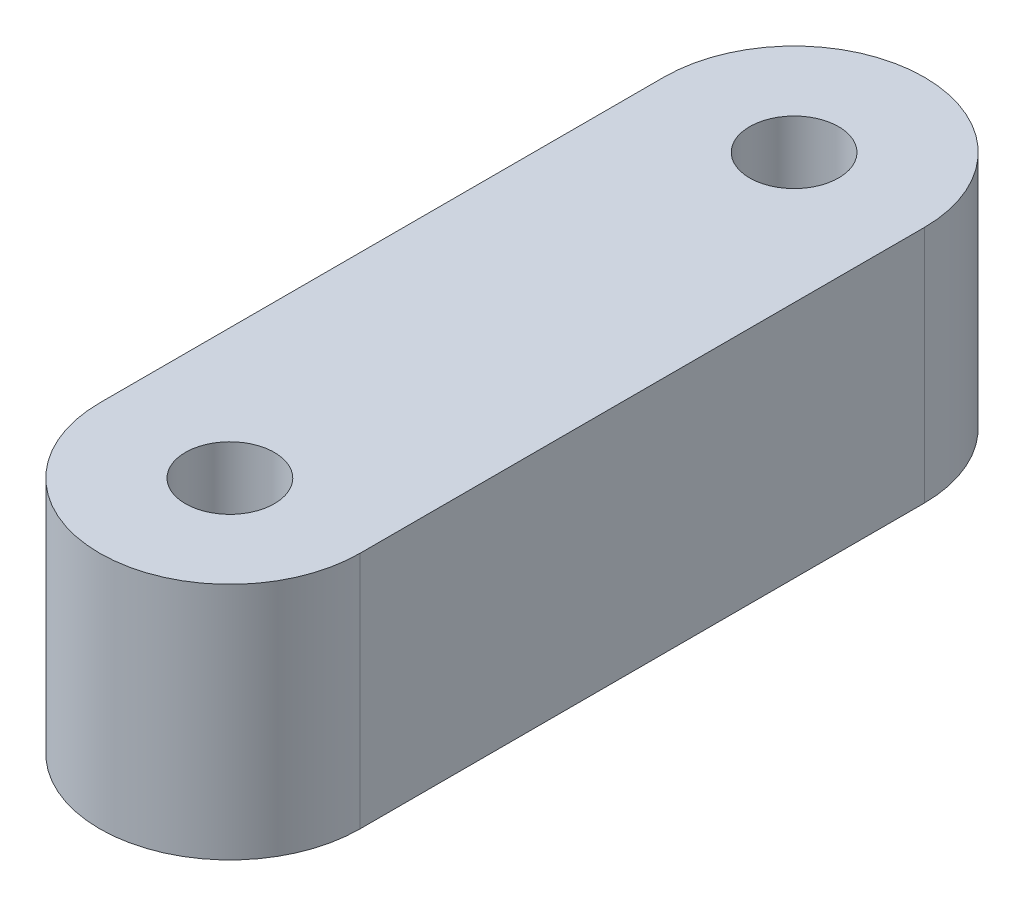
ISO-10303-21;
HEADER;
FILE_DESCRIPTION(('STEP AP214'),'2;1');
FILE_NAME('part.step','',(''),(''),'','','');
FILE_SCHEMA(('AUTOMOTIVE_DESIGN { 1 0 10303 214 1 1 1 1 }'));
ENDSEC;
DATA;
#1=APPLICATION_CONTEXT('core data for automotive mechanical design processes');
#2=APPLICATION_PROTOCOL_DEFINITION('international standard','automotive_design',2000,#1);
#3=PRODUCT_CONTEXT('',#1,'mechanical');
#4=PRODUCT('Part','Part','',(#3));
#5=PRODUCT_RELATED_PRODUCT_CATEGORY('part','',(#4));
#6=PRODUCT_DEFINITION_FORMATION('','',#4);
#7=PRODUCT_DEFINITION_CONTEXT('part definition',#1,'design');
#8=PRODUCT_DEFINITION('design','',#6,#7);
#9=PRODUCT_DEFINITION_SHAPE('','',#8);
#10=(LENGTH_UNIT() NAMED_UNIT(*) SI_UNIT(.MILLI.,.METRE.));
#11=(NAMED_UNIT(*) PLANE_ANGLE_UNIT() SI_UNIT($,.RADIAN.));
#12=(NAMED_UNIT(*) SI_UNIT($,.STERADIAN.) SOLID_ANGLE_UNIT());
#13=UNCERTAINTY_MEASURE_WITH_UNIT(LENGTH_MEASURE(1.E-05),#10,'distance_accuracy_value','');
#14=(GEOMETRIC_REPRESENTATION_CONTEXT(3) GLOBAL_UNCERTAINTY_ASSIGNED_CONTEXT((#13)) GLOBAL_UNIT_ASSIGNED_CONTEXT((#10,
#11,#12)) REPRESENTATION_CONTEXT('',''));
#15=CARTESIAN_POINT('',(0.,0.,0.));
#16=DIRECTION('',(0.,0.,1.));
#17=DIRECTION('',(1.,0.,0.));
#18=AXIS2_PLACEMENT_3D('',#15,#16,#17);
#19=CARTESIAN_POINT('',(4.,5.5,0.));
#20=DIRECTION('',(-1.,0.,0.));
#21=DIRECTION('',(0.,0.,1.));
#22=AXIS2_PLACEMENT_3D('',#19,#20,#21);
#23=CYLINDRICAL_SURFACE('',#22,3.6);
#24=DIRECTION('',(-1.,0.,0.));
#25=VECTOR('',#24,1.);
#26=CARTESIAN_POINT('',(4.,3.45,2.95930735139154));
#27=LINE('',#26,#25);
#28=CARTESIAN_POINT('',(4.,3.45,2.95930735139154));
#29=VERTEX_POINT('',#28);
#30=CARTESIAN_POINT('',(-6.,3.45,2.95930735139154));
#31=VERTEX_POINT('',#30);
#32=EDGE_CURVE('E55',#29,#31,#27,.T.);
#33=ORIENTED_EDGE('',*,*,#32,.T.);
#34=CARTESIAN_POINT('',(-6.,5.5,0.));
#35=DIRECTION('',(-1.,0.,0.));
#36=DIRECTION('',(0.,0.,1.));
#37=AXIS2_PLACEMENT_3D('',#34,#35,#36);
#38=CIRCLE('',#37,3.6);
#39=CARTESIAN_POINT('',(-6.,3.45,-2.95930735139154));
#40=VERTEX_POINT('',#39);
#41=EDGE_CURVE('E113',#31,#40,#38,.T.);
#42=ORIENTED_EDGE('',*,*,#41,.T.);
#43=DIRECTION('',(-1.,0.,0.));
#44=VECTOR('',#43,1.);
#45=CARTESIAN_POINT('',(4.,3.45,-2.95930735139154));
#46=LINE('',#45,#44);
#47=CARTESIAN_POINT('',(4.,3.45,-2.95930735139154));
#48=VERTEX_POINT('',#47);
#49=EDGE_CURVE('E102',#48,#40,#46,.T.);
#50=ORIENTED_EDGE('',*,*,#49,.F.);
#51=CARTESIAN_POINT('',(4.,5.5,0.));
#52=DIRECTION('',(-1.,0.,0.));
#53=DIRECTION('',(0.,0.,1.));
#54=AXIS2_PLACEMENT_3D('',#51,#52,#53);
#55=CIRCLE('',#54,3.6);
#56=EDGE_CURVE('E111',#29,#48,#55,.T.);
#57=ORIENTED_EDGE('',*,*,#56,.F.);
#58=EDGE_LOOP('',(#33,#42,#50,#57));
#59=FACE_BOUND('',#58,.T.);
#60=ADVANCED_FACE('F40',(#59),#23,.F.);
#61=CARTESIAN_POINT('',(4.,5.5,0.));
#62=DIRECTION('',(-1.,0.,0.));
#63=DIRECTION('',(0.,0.,1.));
#64=AXIS2_PLACEMENT_3D('',#61,#62,#63);
#65=PLANE('',#64);
#66=ORIENTED_EDGE('',*,*,#56,.T.);
#67=DIRECTION('',(0.,0.,1.));
#68=VECTOR('',#67,1.);
#69=CARTESIAN_POINT('',(4.,3.45,0.));
#70=LINE('',#69,#68);
#71=EDGE_CURVE('E99',#48,#29,#70,.T.);
#72=ORIENTED_EDGE('',*,*,#71,.T.);
#73=EDGE_LOOP('',(#66,#72));
#74=FACE_BOUND('',#73,.T.);
#75=ADVANCED_FACE('F115',(#74),#65,.T.);
#76=CARTESIAN_POINT('',(0.,11.,13.));
#77=DIRECTION('',(0.,-1.,0.));
#78=DIRECTION('',(0.,0.,-1.));
#79=AXIS2_PLACEMENT_3D('',#76,#77,#78);
#80=CYLINDRICAL_SURFACE('',#79,6.);
#81=CARTESIAN_POINT('',(0.,0.,13.));
#82=DIRECTION('',(0.,1.,0.));
#83=DIRECTION('',(0.,0.,1.));
#84=AXIS2_PLACEMENT_3D('',#81,#82,#83);
#85=CIRCLE('',#84,6.);
#86=CARTESIAN_POINT('',(-6.,0.,13.));
#87=VERTEX_POINT('',#86);
#88=CARTESIAN_POINT('',(6.,0.,13.));
#89=VERTEX_POINT('',#88);
#90=EDGE_CURVE('E127',#87,#89,#85,.T.);
#91=ORIENTED_EDGE('',*,*,#90,.T.);
#92=DIRECTION('',(0.,-1.,0.));
#93=VECTOR('',#92,1.);
#94=CARTESIAN_POINT('',(6.,11.,13.));
#95=LINE('',#94,#93);
#96=CARTESIAN_POINT('',(6.,11.,13.));
#97=VERTEX_POINT('',#96);
#98=EDGE_CURVE('E11',#97,#89,#95,.T.);
#99=ORIENTED_EDGE('',*,*,#98,.F.);
#100=CARTESIAN_POINT('',(0.,11.,13.));
#101=DIRECTION('',(0.,1.,0.));
#102=DIRECTION('',(0.,0.,1.));
#103=AXIS2_PLACEMENT_3D('',#100,#101,#102);
#104=CIRCLE('',#103,6.);
#105=CARTESIAN_POINT('',(-6.,11.,13.));
#106=VERTEX_POINT('',#105);
#107=EDGE_CURVE('E133',#106,#97,#104,.T.);
#108=ORIENTED_EDGE('',*,*,#107,.F.);
#109=DIRECTION('',(0.,-1.,0.));
#110=VECTOR('',#109,1.);
#111=CARTESIAN_POINT('',(-6.,11.,13.));
#112=LINE('',#111,#110);
#113=EDGE_CURVE('E139',#106,#87,#112,.T.);
#114=ORIENTED_EDGE('',*,*,#113,.T.);
#115=EDGE_LOOP('',(#91,#99,#108,#114));
#116=FACE_BOUND('',#115,.T.);
#117=ADVANCED_FACE('F42',(#116),#80,.T.);
#118=CARTESIAN_POINT('',(6.,11.,13.));
#119=DIRECTION('',(-1.,0.,0.));
#120=DIRECTION('',(0.,0.,1.));
#121=AXIS2_PLACEMENT_3D('',#118,#119,#120);
#122=PLANE('',#121);
#123=DIRECTION('',(0.,0.,-1.));
#124=VECTOR('',#123,1.);
#125=CARTESIAN_POINT('',(6.,0.,13.));
#126=LINE('',#125,#124);
#127=CARTESIAN_POINT('',(6.,0.,-13.));
#128=VERTEX_POINT('',#127);
#129=EDGE_CURVE('E142',#89,#128,#126,.T.);
#130=ORIENTED_EDGE('',*,*,#129,.T.);
#131=DIRECTION('',(0.,-1.,0.));
#132=VECTOR('',#131,1.);
#133=CARTESIAN_POINT('',(6.,11.,-13.));
#134=LINE('',#133,#132);
#135=CARTESIAN_POINT('',(6.,11.,-13.));
#136=VERTEX_POINT('',#135);
#137=EDGE_CURVE('E48',#136,#128,#134,.T.);
#138=ORIENTED_EDGE('',*,*,#137,.F.);
#139=DIRECTION('',(0.,0.,-1.));
#140=VECTOR('',#139,1.);
#141=CARTESIAN_POINT('',(6.,11.,13.));
#142=LINE('',#141,#140);
#143=EDGE_CURVE('E92',#97,#136,#142,.T.);
#144=ORIENTED_EDGE('',*,*,#143,.F.);
#145=ORIENTED_EDGE('',*,*,#98,.T.);
#146=EDGE_LOOP('',(#130,#138,#144,#145));
#147=FACE_BOUND('',#146,.T.);
#148=ADVANCED_FACE('F172',(#147),#122,.F.);
#149=CARTESIAN_POINT('',(0.,11.,-13.));
#150=DIRECTION('',(0.,-1.,0.));
#151=DIRECTION('',(0.,0.,-1.));
#152=AXIS2_PLACEMENT_3D('',#149,#150,#151);
#153=CYLINDRICAL_SURFACE('',#152,6.);
#154=CARTESIAN_POINT('',(0.,0.,-13.));
#155=DIRECTION('',(0.,1.,0.));
#156=DIRECTION('',(0.,0.,1.));
#157=AXIS2_PLACEMENT_3D('',#154,#155,#156);
#158=CIRCLE('',#157,6.);
#159=CARTESIAN_POINT('',(-6.00000000000001,0.,-13.));
#160=VERTEX_POINT('',#159);
#161=EDGE_CURVE('E144',#128,#160,#158,.T.);
#162=ORIENTED_EDGE('',*,*,#161,.T.);
#163=DIRECTION('',(0.,-1.,0.));
#164=VECTOR('',#163,1.);
#165=CARTESIAN_POINT('',(-6.00000000000001,11.,-13.));
#166=LINE('',#165,#164);
#167=CARTESIAN_POINT('',(-6.00000000000001,11.,-13.));
#168=VERTEX_POINT('',#167);
#169=EDGE_CURVE('E148',#168,#160,#166,.T.);
#170=ORIENTED_EDGE('',*,*,#169,.F.);
#171=CARTESIAN_POINT('',(0.,11.,-13.));
#172=DIRECTION('',(0.,1.,0.));
#173=DIRECTION('',(0.,0.,1.));
#174=AXIS2_PLACEMENT_3D('',#171,#172,#173);
#175=CIRCLE('',#174,6.);
#176=EDGE_CURVE('E136',#136,#168,#175,.T.);
#177=ORIENTED_EDGE('',*,*,#176,.F.);
#178=ORIENTED_EDGE('',*,*,#137,.T.);
#179=EDGE_LOOP('',(#162,#170,#177,#178));
#180=FACE_BOUND('',#179,.T.);
#181=ADVANCED_FACE('F153',(#180),#153,.T.);
#182=CARTESIAN_POINT('',(-6.,11.,13.));
#183=DIRECTION('',(1.,0.,0.));
#184=DIRECTION('',(0.,0.,-1.));
#185=AXIS2_PLACEMENT_3D('',#182,#183,#184);
#186=PLANE('',#185);
#187=ORIENTED_EDGE('',*,*,#41,.F.);
#188=DIRECTION('',(0.,0.,1.));
#189=VECTOR('',#188,1.);
#190=CARTESIAN_POINT('',(-6.,3.45,0.));
#191=LINE('',#190,#189);
#192=EDGE_CURVE('E107',#40,#31,#191,.T.);
#193=ORIENTED_EDGE('',*,*,#192,.F.);
#194=EDGE_LOOP('',(#187,#193));
#195=FACE_BOUND('',#194,.T.);
#196=DIRECTION('',(0.,0.,1.));
#197=VECTOR('',#196,1.);
#198=CARTESIAN_POINT('',(-6.,0.,13.));
#199=LINE('',#198,#197);
#200=EDGE_CURVE('E85',#160,#87,#199,.T.);
#201=ORIENTED_EDGE('',*,*,#200,.T.);
#202=ORIENTED_EDGE('',*,*,#113,.F.);
#203=DIRECTION('',(0.,0.,1.));
#204=VECTOR('',#203,1.);
#205=CARTESIAN_POINT('',(-6.,11.,13.));
#206=LINE('',#205,#204);
#207=EDGE_CURVE('E64',#168,#106,#206,.T.);
#208=ORIENTED_EDGE('',*,*,#207,.F.);
#209=ORIENTED_EDGE('',*,*,#169,.T.);
#210=EDGE_LOOP('',(#201,#202,#208,#209));
#211=FACE_BOUND('',#210,.T.);
#212=ADVANCED_FACE('F161',(#195,#211),#186,.F.);
#213=CARTESIAN_POINT('',(0.,11.,13.));
#214=DIRECTION('',(0.,1.,0.));
#215=DIRECTION('',(0.,0.,1.));
#216=AXIS2_PLACEMENT_3D('',#213,#214,#215);
#217=PLANE('',#216);
#218=CARTESIAN_POINT('',(0.,11.,-13.));
#219=DIRECTION('',(0.,1.,0.));
#220=DIRECTION('',(0.,0.,1.));
#221=AXIS2_PLACEMENT_3D('',#218,#219,#220);
#222=CIRCLE('',#221,2.05);
#223=CARTESIAN_POINT('',(0.,11.,-10.95));
#224=VERTEX_POINT('',#223);
#225=EDGE_CURVE('E128',#224,#224,#222,.T.);
#226=ORIENTED_EDGE('',*,*,#225,.F.);
#227=EDGE_LOOP('',(#226));
#228=FACE_BOUND('',#227,.T.);
#229=CARTESIAN_POINT('',(0.,11.,13.));
#230=DIRECTION('',(0.,1.,0.));
#231=DIRECTION('',(0.,0.,1.));
#232=AXIS2_PLACEMENT_3D('',#229,#230,#231);
#233=CIRCLE('',#232,2.05);
#234=CARTESIAN_POINT('',(0.,11.,15.05));
#235=VERTEX_POINT('',#234);
#236=EDGE_CURVE('E116',#235,#235,#233,.T.);
#237=ORIENTED_EDGE('',*,*,#236,.F.);
#238=EDGE_LOOP('',(#237));
#239=FACE_BOUND('',#238,.T.);
#240=ORIENTED_EDGE('',*,*,#107,.T.);
#241=ORIENTED_EDGE('',*,*,#143,.T.);
#242=ORIENTED_EDGE('',*,*,#176,.T.);
#243=ORIENTED_EDGE('',*,*,#207,.T.);
#244=EDGE_LOOP('',(#240,#241,#242,#243));
#245=FACE_BOUND('',#244,.T.);
#246=ADVANCED_FACE('F163',(#228,#239,#245),#217,.T.);
#247=CARTESIAN_POINT('',(0.,0.,13.));
#248=DIRECTION('',(0.,1.,0.));
#249=DIRECTION('',(0.,0.,1.));
#250=AXIS2_PLACEMENT_3D('',#247,#248,#249);
#251=PLANE('',#250);
#252=CARTESIAN_POINT('',(0.,0.,-13.));
#253=DIRECTION('',(0.,1.,0.));
#254=DIRECTION('',(0.,0.,1.));
#255=AXIS2_PLACEMENT_3D('',#252,#253,#254);
#256=CIRCLE('',#255,2.05);
#257=CARTESIAN_POINT('',(0.,0.,-10.95));
#258=VERTEX_POINT('',#257);
#259=EDGE_CURVE('E124',#258,#258,#256,.T.);
#260=ORIENTED_EDGE('',*,*,#259,.T.);
#261=EDGE_LOOP('',(#260));
#262=FACE_BOUND('',#261,.T.);
#263=CARTESIAN_POINT('',(0.,0.,13.));
#264=DIRECTION('',(0.,1.,0.));
#265=DIRECTION('',(0.,0.,1.));
#266=AXIS2_PLACEMENT_3D('',#263,#264,#265);
#267=CIRCLE('',#266,2.05);
#268=CARTESIAN_POINT('',(0.,0.,15.05));
#269=VERTEX_POINT('',#268);
#270=EDGE_CURVE('E119',#269,#269,#267,.T.);
#271=ORIENTED_EDGE('',*,*,#270,.T.);
#272=EDGE_LOOP('',(#271));
#273=FACE_BOUND('',#272,.T.);
#274=ORIENTED_EDGE('',*,*,#90,.F.);
#275=ORIENTED_EDGE('',*,*,#200,.F.);
#276=ORIENTED_EDGE('',*,*,#161,.F.);
#277=ORIENTED_EDGE('',*,*,#129,.F.);
#278=EDGE_LOOP('',(#274,#275,#276,#277));
#279=FACE_BOUND('',#278,.T.);
#280=ADVANCED_FACE('F157',(#262,#273,#279),#251,.F.);
#281=CARTESIAN_POINT('',(0.,0.,13.));
#282=DIRECTION('',(0.,1.,0.));
#283=DIRECTION('',(0.,0.,1.));
#284=AXIS2_PLACEMENT_3D('',#281,#282,#283);
#285=CYLINDRICAL_SURFACE('',#284,2.05);
#286=ORIENTED_EDGE('',*,*,#270,.F.);
#287=EDGE_LOOP('',(#286));
#288=FACE_BOUND('',#287,.T.);
#289=ORIENTED_EDGE('',*,*,#236,.T.);
#290=EDGE_LOOP('',(#289));
#291=FACE_BOUND('',#290,.T.);
#292=ADVANCED_FACE('F186',(#288,#291),#285,.F.);
#293=CARTESIAN_POINT('',(0.,0.,-13.));
#294=DIRECTION('',(0.,1.,0.));
#295=DIRECTION('',(0.,0.,1.));
#296=AXIS2_PLACEMENT_3D('',#293,#294,#295);
#297=CYLINDRICAL_SURFACE('',#296,2.05);
#298=ORIENTED_EDGE('',*,*,#259,.F.);
#299=EDGE_LOOP('',(#298));
#300=FACE_BOUND('',#299,.T.);
#301=ORIENTED_EDGE('',*,*,#225,.T.);
#302=EDGE_LOOP('',(#301));
#303=FACE_BOUND('',#302,.T.);
#304=ADVANCED_FACE('F183',(#300,#303),#297,.F.);
#305=CARTESIAN_POINT('',(4.,3.45,0.));
#306=DIRECTION('',(0.,-1.,0.));
#307=DIRECTION('',(0.,0.,-1.));
#308=AXIS2_PLACEMENT_3D('',#305,#306,#307);
#309=PLANE('',#308);
#310=ORIENTED_EDGE('',*,*,#192,.T.);
#311=ORIENTED_EDGE('',*,*,#32,.F.);
#312=ORIENTED_EDGE('',*,*,#71,.F.);
#313=ORIENTED_EDGE('',*,*,#49,.T.);
#314=EDGE_LOOP('',(#310,#311,#312,#313));
#315=FACE_BOUND('',#314,.T.);
#316=ADVANCED_FACE('F101',(#315),#309,.F.);
#317=CLOSED_SHELL('',(#60,#75,#117,#148,#181,#212,#246,#280,#292,#304,#316));
#318=MANIFOLD_SOLID_BREP('B2',#317);
#319=ADVANCED_BREP_SHAPE_REPRESENTATION('',(#18,#318),#14);
#320=SHAPE_DEFINITION_REPRESENTATION(#9,#319);
ENDSEC;
END-ISO-10303-21;
